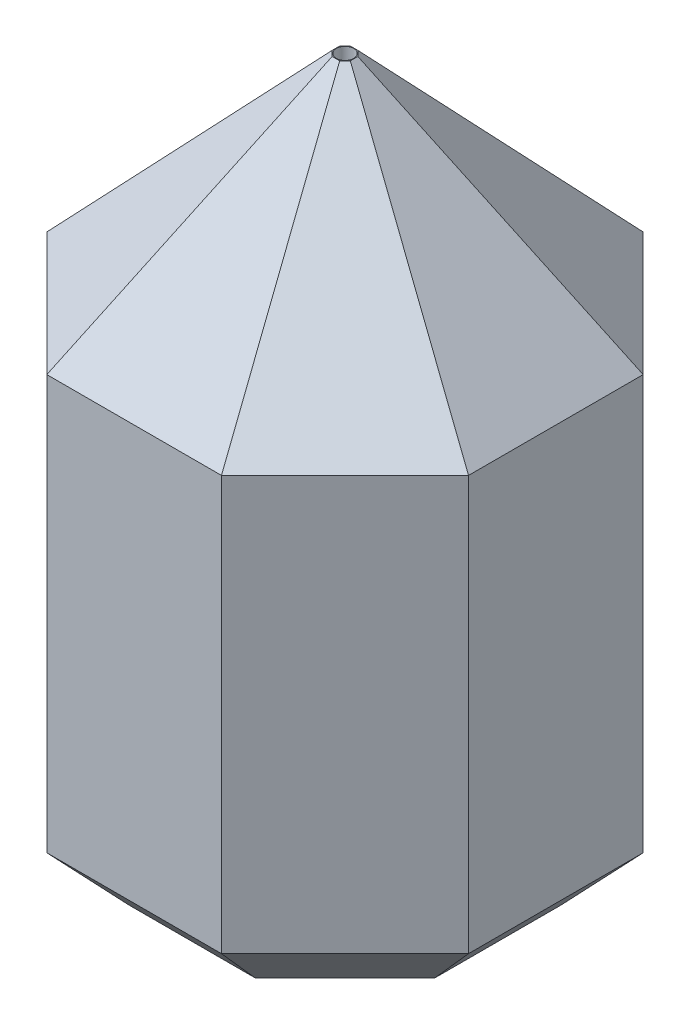
ISO-10303-21;
HEADER;
FILE_DESCRIPTION(('STEP AP214'),'2;1');
FILE_NAME('part.step','',(''),(''),'','','');
FILE_SCHEMA(('AUTOMOTIVE_DESIGN { 1 0 10303 214 1 1 1 1 }'));
ENDSEC;
DATA;
#1=APPLICATION_CONTEXT('core data for automotive mechanical design processes');
#2=APPLICATION_PROTOCOL_DEFINITION('international standard','automotive_design',2000,#1);
#3=PRODUCT_CONTEXT('',#1,'mechanical');
#4=PRODUCT('Part','Part','',(#3));
#5=PRODUCT_RELATED_PRODUCT_CATEGORY('part','',(#4));
#6=PRODUCT_DEFINITION_FORMATION('','',#4);
#7=PRODUCT_DEFINITION_CONTEXT('part definition',#1,'design');
#8=PRODUCT_DEFINITION('design','',#6,#7);
#9=PRODUCT_DEFINITION_SHAPE('','',#8);
#10=(LENGTH_UNIT() NAMED_UNIT(*) SI_UNIT(.MILLI.,.METRE.));
#11=(NAMED_UNIT(*) PLANE_ANGLE_UNIT() SI_UNIT($,.RADIAN.));
#12=(NAMED_UNIT(*) SI_UNIT($,.STERADIAN.) SOLID_ANGLE_UNIT());
#13=UNCERTAINTY_MEASURE_WITH_UNIT(LENGTH_MEASURE(1.E-05),#10,'distance_accuracy_value','');
#14=(GEOMETRIC_REPRESENTATION_CONTEXT(3) GLOBAL_UNCERTAINTY_ASSIGNED_CONTEXT((#13)) GLOBAL_UNIT_ASSIGNED_CONTEXT((#10,
#11,#12)) REPRESENTATION_CONTEXT('',''));
#15=CARTESIAN_POINT('',(0.,0.,0.));
#16=DIRECTION('',(0.,0.,1.));
#17=DIRECTION('',(1.,0.,0.));
#18=AXIS2_PLACEMENT_3D('',#15,#16,#17);
#19=CARTESIAN_POINT('',(0.,85.,0.));
#20=DIRECTION('',(0.,-1.,0.));
#21=DIRECTION('',(0.,0.,-1.));
#22=AXIS2_PLACEMENT_3D('',#19,#20,#21);
#23=PLANE('',#22);
#24=CARTESIAN_POINT('',(0.,85.,0.));
#25=DIRECTION('',(0.,-1.,0.));
#26=DIRECTION('',(0.,0.,-1.));
#27=AXIS2_PLACEMENT_3D('',#24,#25,#26);
#28=CIRCLE('',#27,1.5);
#29=CARTESIAN_POINT('',(0.,85.,-1.5));
#30=VERTEX_POINT('',#29);
#31=EDGE_CURVE('E251',#30,#30,#28,.T.);
#32=ORIENTED_EDGE('',*,*,#31,.F.);
#33=EDGE_LOOP('',(#32));
#34=FACE_BOUND('',#33,.T.);
#35=CARTESIAN_POINT('',(0.,85.,0.));
#36=DIRECTION('',(0.,-1.,0.));
#37=DIRECTION('',(0.,0.,-1.));
#38=AXIS2_PLACEMENT_3D('',#35,#36,#37);
#39=CIRCLE('',#38,8.);
#40=CARTESIAN_POINT('',(0.,85.,8.));
#41=VERTEX_POINT('',#40);
#42=EDGE_CURVE('E301',#41,#41,#39,.F.);
#43=ORIENTED_EDGE('',*,*,#42,.F.);
#44=EDGE_LOOP('',(#43));
#45=FACE_BOUND('',#44,.T.);
#46=ADVANCED_FACE('F37',(#34,#45),#23,.T.);
#47=CARTESIAN_POINT('',(17.,120.,17.));
#48=DIRECTION('',(-1.,0.,0.));
#49=DIRECTION('',(0.,0.,1.));
#50=AXIS2_PLACEMENT_3D('',#47,#48,#49);
#51=PLANE('',#50);
#52=DIRECTION('',(0.,0.,1.));
#53=VECTOR('',#52,1.);
#54=CARTESIAN_POINT('',(17.,72.,-17.));
#55=LINE('',#54,#53);
#56=CARTESIAN_POINT('',(17.,72.,-17.));
#57=VERTEX_POINT('',#56);
#58=CARTESIAN_POINT('',(17.,72.,17.));
#59=VERTEX_POINT('',#58);
#60=EDGE_CURVE('E245',#57,#59,#55,.T.);
#61=ORIENTED_EDGE('',*,*,#60,.F.);
#62=DIRECTION('',(0.,-1.,0.));
#63=VECTOR('',#62,1.);
#64=CARTESIAN_POINT('',(17.,120.,-17.));
#65=LINE('',#64,#63);
#66=CARTESIAN_POINT('',(17.,0.,-17.));
#67=VERTEX_POINT('',#66);
#68=EDGE_CURVE('E277',#57,#67,#65,.T.);
#69=ORIENTED_EDGE('',*,*,#68,.T.);
#70=DIRECTION('',(0.,0.,-1.));
#71=VECTOR('',#70,1.);
#72=CARTESIAN_POINT('',(17.,0.,17.));
#73=LINE('',#72,#71);
#74=CARTESIAN_POINT('',(17.,0.,17.));
#75=VERTEX_POINT('',#74);
#76=EDGE_CURVE('E257',#75,#67,#73,.T.);
#77=ORIENTED_EDGE('',*,*,#76,.F.);
#78=DIRECTION('',(0.,-1.,0.));
#79=VECTOR('',#78,1.);
#80=CARTESIAN_POINT('',(17.,120.,17.));
#81=LINE('',#80,#79);
#82=EDGE_CURVE('E270',#59,#75,#81,.T.);
#83=ORIENTED_EDGE('',*,*,#82,.F.);
#84=EDGE_LOOP('',(#61,#69,#77,#83));
#85=FACE_BOUND('',#84,.T.);
#86=ADVANCED_FACE('F514',(#85),#51,.T.);
#87=CARTESIAN_POINT('',(-17.,120.,-17.));
#88=DIRECTION('',(0.,0.,1.));
#89=DIRECTION('',(1.,0.,0.));
#90=AXIS2_PLACEMENT_3D('',#87,#88,#89);
#91=PLANE('',#90);
#92=DIRECTION('',(1.,0.,0.));
#93=VECTOR('',#92,1.);
#94=CARTESIAN_POINT('',(-17.,72.,-17.));
#95=LINE('',#94,#93);
#96=CARTESIAN_POINT('',(-17.,72.,-17.));
#97=VERTEX_POINT('',#96);
#98=EDGE_CURVE('E242',#97,#57,#95,.T.);
#99=ORIENTED_EDGE('',*,*,#98,.F.);
#100=DIRECTION('',(0.,-1.,0.));
#101=VECTOR('',#100,1.);
#102=CARTESIAN_POINT('',(-17.,120.,-17.));
#103=LINE('',#102,#101);
#104=CARTESIAN_POINT('',(-17.,0.,-17.));
#105=VERTEX_POINT('',#104);
#106=EDGE_CURVE('E275',#97,#105,#103,.T.);
#107=ORIENTED_EDGE('',*,*,#106,.T.);
#108=DIRECTION('',(-1.,0.,0.));
#109=VECTOR('',#108,1.);
#110=CARTESIAN_POINT('',(-17.,0.,-17.));
#111=LINE('',#110,#109);
#112=EDGE_CURVE('E260',#67,#105,#111,.T.);
#113=ORIENTED_EDGE('',*,*,#112,.F.);
#114=ORIENTED_EDGE('',*,*,#68,.F.);
#115=EDGE_LOOP('',(#99,#107,#113,#114));
#116=FACE_BOUND('',#115,.T.);
#117=ADVANCED_FACE('F520',(#116),#91,.T.);
#118=CARTESIAN_POINT('',(-17.,120.,17.));
#119=DIRECTION('',(1.,0.,0.));
#120=DIRECTION('',(0.,0.,-1.));
#121=AXIS2_PLACEMENT_3D('',#118,#119,#120);
#122=PLANE('',#121);
#123=DIRECTION('',(0.,-1.,0.));
#124=VECTOR('',#123,1.);
#125=CARTESIAN_POINT('',(-17.,20.,2.));
#126=LINE('',#125,#124);
#127=CARTESIAN_POINT('',(-17.,20.,2.));
#128=VERTEX_POINT('',#127);
#129=CARTESIAN_POINT('',(-17.,0.,2.));
#130=VERTEX_POINT('',#129);
#131=EDGE_CURVE('E232',#128,#130,#126,.T.);
#132=ORIENTED_EDGE('',*,*,#131,.F.);
#133=DIRECTION('',(0.,0.,1.));
#134=VECTOR('',#133,1.);
#135=CARTESIAN_POINT('',(-17.,20.,0.));
#136=LINE('',#135,#134);
#137=CARTESIAN_POINT('',(-17.,20.,-2.));
#138=VERTEX_POINT('',#137);
#139=EDGE_CURVE('E209',#138,#128,#136,.T.);
#140=ORIENTED_EDGE('',*,*,#139,.F.);
#141=DIRECTION('',(0.,-1.,0.));
#142=VECTOR('',#141,1.);
#143=CARTESIAN_POINT('',(-17.,20.,-2.));
#144=LINE('',#143,#142);
#145=CARTESIAN_POINT('',(-17.,0.,-2.));
#146=VERTEX_POINT('',#145);
#147=EDGE_CURVE('E205',#138,#146,#144,.T.);
#148=ORIENTED_EDGE('',*,*,#147,.T.);
#149=DIRECTION('',(0.,0.,1.));
#150=VECTOR('',#149,1.);
#151=CARTESIAN_POINT('',(-17.,0.,17.));
#152=LINE('',#151,#150);
#153=EDGE_CURVE('E264',#105,#146,#152,.T.);
#154=ORIENTED_EDGE('',*,*,#153,.F.);
#155=ORIENTED_EDGE('',*,*,#106,.F.);
#156=DIRECTION('',(0.,0.,-1.));
#157=VECTOR('',#156,1.);
#158=CARTESIAN_POINT('',(-17.,72.,17.));
#159=LINE('',#158,#157);
#160=CARTESIAN_POINT('',(-17.,72.,17.));
#161=VERTEX_POINT('',#160);
#162=EDGE_CURVE('E238',#161,#97,#159,.T.);
#163=ORIENTED_EDGE('',*,*,#162,.F.);
#164=DIRECTION('',(0.,-1.,0.));
#165=VECTOR('',#164,1.);
#166=CARTESIAN_POINT('',(-17.,120.,17.));
#167=LINE('',#166,#165);
#168=CARTESIAN_POINT('',(-17.,0.,17.));
#169=VERTEX_POINT('',#168);
#170=EDGE_CURVE('E272',#161,#169,#167,.T.);
#171=ORIENTED_EDGE('',*,*,#170,.T.);
#172=EDGE_CURVE('E263',#130,#169,#152,.T.);
#173=ORIENTED_EDGE('',*,*,#172,.F.);
#174=EDGE_LOOP('',(#132,#140,#148,#154,#155,#163,#171,#173));
#175=FACE_BOUND('',#174,.T.);
#176=ADVANCED_FACE('F534',(#175),#122,.T.);
#177=CARTESIAN_POINT('',(-17.,120.,17.));
#178=DIRECTION('',(0.,0.,-1.));
#179=DIRECTION('',(-1.,0.,0.));
#180=AXIS2_PLACEMENT_3D('',#177,#178,#179);
#181=PLANE('',#180);
#182=DIRECTION('',(-1.,0.,0.));
#183=VECTOR('',#182,1.);
#184=CARTESIAN_POINT('',(17.,72.,17.));
#185=LINE('',#184,#183);
#186=EDGE_CURVE('E248',#59,#161,#185,.T.);
#187=ORIENTED_EDGE('',*,*,#186,.F.);
#188=ORIENTED_EDGE('',*,*,#82,.T.);
#189=DIRECTION('',(1.,0.,0.));
#190=VECTOR('',#189,1.);
#191=CARTESIAN_POINT('',(-17.,0.,17.));
#192=LINE('',#191,#190);
#193=EDGE_CURVE('E267',#169,#75,#192,.T.);
#194=ORIENTED_EDGE('',*,*,#193,.F.);
#195=ORIENTED_EDGE('',*,*,#170,.F.);
#196=EDGE_LOOP('',(#187,#188,#194,#195));
#197=FACE_BOUND('',#196,.T.);
#198=ADVANCED_FACE('F531',(#197),#181,.T.);
#199=CARTESIAN_POINT('',(0.,120.,0.));
#200=DIRECTION('',(0.,1.,0.));
#201=DIRECTION('',(0.,0.,1.));
#202=AXIS2_PLACEMENT_3D('',#199,#200,#201);
#203=PLANE('',#202);
#204=DIRECTION('',(-0.707106781186548,0.,-0.707106781186547));
#205=VECTOR('',#204,1.);
#206=CARTESIAN_POINT('',(-9.59100131693012,120.,-11.8145902740914));
#207=LINE('',#206,#205);
#208=CARTESIAN_POINT('',(1.57231483018025,120.,-0.651274126981041));
#209=VERTEX_POINT('',#208);
#210=CARTESIAN_POINT('',(0.651274126981014,120.,-1.57231483018028));
#211=VERTEX_POINT('',#210);
#212=EDGE_CURVE('E310',#209,#211,#207,.T.);
#213=ORIENTED_EDGE('',*,*,#212,.T.);
#214=DIRECTION('',(-1.,0.,0.));
#215=VECTOR('',#214,1.);
#216=CARTESIAN_POINT('',(-15.1360389693211,120.,-1.57231483018028));
#217=LINE('',#216,#215);
#218=CARTESIAN_POINT('',(-0.651274126981009,120.,-1.57231483018028));
#219=VERTEX_POINT('',#218);
#220=EDGE_CURVE('E318',#211,#219,#217,.T.);
#221=ORIENTED_EDGE('',*,*,#220,.T.);
#222=DIRECTION('',(-0.707106781186547,0.,0.707106781186548));
#223=VECTOR('',#222,1.);
#224=CARTESIAN_POINT('',(-11.8145902740914,120.,9.59100131693014));
#225=LINE('',#224,#223);
#226=CARTESIAN_POINT('',(-1.57231483018027,120.,-0.651274126981013));
#227=VERTEX_POINT('',#226);
#228=EDGE_CURVE('E316',#219,#227,#225,.T.);
#229=ORIENTED_EDGE('',*,*,#228,.T.);
#230=DIRECTION('',(0.,0.,1.));
#231=VECTOR('',#230,1.);
#232=CARTESIAN_POINT('',(-1.57231483018027,120.,15.1360389693211));
#233=LINE('',#232,#231);
#234=CARTESIAN_POINT('',(-1.57231483018027,120.,0.651274126981008));
#235=VERTEX_POINT('',#234);
#236=EDGE_CURVE('E314',#227,#235,#233,.T.);
#237=ORIENTED_EDGE('',*,*,#236,.T.);
#238=DIRECTION('',(0.707106781186548,0.,0.707106781186547));
#239=VECTOR('',#238,1.);
#240=CARTESIAN_POINT('',(9.59100131693013,120.,11.8145902740914));
#241=LINE('',#240,#239);
#242=CARTESIAN_POINT('',(-0.651274126981029,120.,1.57231483018025));
#243=VERTEX_POINT('',#242);
#244=EDGE_CURVE('E312',#235,#243,#241,.T.);
#245=ORIENTED_EDGE('',*,*,#244,.T.);
#246=DIRECTION('',(1.,0.,0.));
#247=VECTOR('',#246,1.);
#248=CARTESIAN_POINT('',(15.1360389693211,120.,1.57231483018025));
#249=LINE('',#248,#247);
#250=CARTESIAN_POINT('',(0.651274126981014,120.,1.57231483018025));
#251=VERTEX_POINT('',#250);
#252=EDGE_CURVE('E304',#243,#251,#249,.T.);
#253=ORIENTED_EDGE('',*,*,#252,.T.);
#254=DIRECTION('',(0.707106781186547,0.,-0.707106781186548));
#255=VECTOR('',#254,1.);
#256=CARTESIAN_POINT('',(11.8145902740914,120.,-9.59100131693013));
#257=LINE('',#256,#255);
#258=CARTESIAN_POINT('',(1.57231483018025,120.,0.651274126981019));
#259=VERTEX_POINT('',#258);
#260=EDGE_CURVE('E306',#251,#259,#257,.T.);
#261=ORIENTED_EDGE('',*,*,#260,.T.);
#262=DIRECTION('',(0.,0.,-1.));
#263=VECTOR('',#262,1.);
#264=CARTESIAN_POINT('',(1.57231483018025,120.,-15.1360389693211));
#265=LINE('',#264,#263);
#266=EDGE_CURVE('E308',#259,#209,#265,.T.);
#267=ORIENTED_EDGE('',*,*,#266,.T.);
#268=EDGE_LOOP('',(#213,#221,#229,#237,#245,#253,#261,#267));
#269=FACE_BOUND('',#268,.T.);
#270=CARTESIAN_POINT('',(0.,120.,0.));
#271=DIRECTION('',(0.,1.,0.));
#272=DIRECTION('',(0.,0.,1.));
#273=AXIS2_PLACEMENT_3D('',#270,#271,#272);
#274=CIRCLE('',#273,1.5);
#275=CARTESIAN_POINT('',(0.,120.,1.5));
#276=VERTEX_POINT('',#275);
#277=EDGE_CURVE('E254',#276,#276,#274,.T.);
#278=ORIENTED_EDGE('',*,*,#277,.F.);
#279=EDGE_LOOP('',(#278));
#280=FACE_BOUND('',#279,.T.);
#281=ADVANCED_FACE('F471',(#269,#280),#203,.T.);
#282=CARTESIAN_POINT('',(0.,0.,0.));
#283=DIRECTION('',(0.,1.,0.));
#284=DIRECTION('',(0.,0.,1.));
#285=AXIS2_PLACEMENT_3D('',#282,#283,#284);
#286=PLANE('',#285);
#287=DIRECTION('',(-1.,0.,0.));
#288=VECTOR('',#287,1.);
#289=CARTESIAN_POINT('',(0.,0.,26.5416305603426));
#290=LINE('',#289,#288);
#291=CARTESIAN_POINT('',(10.9939033455901,0.,26.5416305603426));
#292=VERTEX_POINT('',#291);
#293=CARTESIAN_POINT('',(-10.9939033455901,0.,26.5416305603426));
#294=VERTEX_POINT('',#293);
#295=EDGE_CURVE('E362',#292,#294,#290,.T.);
#296=ORIENTED_EDGE('',*,*,#295,.T.);
#297=DIRECTION('',(-0.707106781186548,0.,-0.707106781186547));
#298=VECTOR('',#297,1.);
#299=CARTESIAN_POINT('',(-18.7677669529663,0.,18.7677669529664));
#300=LINE('',#299,#298);
#301=CARTESIAN_POINT('',(-26.5416305603426,0.,10.9939033455901));
#302=VERTEX_POINT('',#301);
#303=EDGE_CURVE('E376',#294,#302,#300,.T.);
#304=ORIENTED_EDGE('',*,*,#303,.T.);
#305=DIRECTION('',(0.,0.,-1.));
#306=VECTOR('',#305,1.);
#307=CARTESIAN_POINT('',(-26.5416305603426,0.,0.));
#308=LINE('',#307,#306);
#309=CARTESIAN_POINT('',(-26.5416305603426,0.,-10.9939033455901));
#310=VERTEX_POINT('',#309);
#311=EDGE_CURVE('E374',#302,#310,#308,.T.);
#312=ORIENTED_EDGE('',*,*,#311,.T.);
#313=DIRECTION('',(0.707106781186547,0.,-0.707106781186548));
#314=VECTOR('',#313,1.);
#315=CARTESIAN_POINT('',(-18.7677669529663,0.,-18.7677669529663));
#316=LINE('',#315,#314);
#317=CARTESIAN_POINT('',(-10.9939033455901,0.,-26.5416305603426));
#318=VERTEX_POINT('',#317);
#319=EDGE_CURVE('E372',#310,#318,#316,.T.);
#320=ORIENTED_EDGE('',*,*,#319,.T.);
#321=DIRECTION('',(1.,0.,0.));
#322=VECTOR('',#321,1.);
#323=CARTESIAN_POINT('',(0.,0.,-26.5416305603426));
#324=LINE('',#323,#322);
#325=CARTESIAN_POINT('',(10.9939033455901,0.,-26.5416305603426));
#326=VERTEX_POINT('',#325);
#327=EDGE_CURVE('E370',#318,#326,#324,.T.);
#328=ORIENTED_EDGE('',*,*,#327,.T.);
#329=DIRECTION('',(0.707106781186548,0.,0.707106781186547));
#330=VECTOR('',#329,1.);
#331=CARTESIAN_POINT('',(18.7677669529663,0.,-18.7677669529664));
#332=LINE('',#331,#330);
#333=CARTESIAN_POINT('',(26.5416305603426,0.,-10.9939033455901));
#334=VERTEX_POINT('',#333);
#335=EDGE_CURVE('E368',#326,#334,#332,.T.);
#336=ORIENTED_EDGE('',*,*,#335,.T.);
#337=DIRECTION('',(0.,0.,1.));
#338=VECTOR('',#337,1.);
#339=CARTESIAN_POINT('',(26.5416305603426,0.,0.));
#340=LINE('',#339,#338);
#341=CARTESIAN_POINT('',(26.5416305603426,0.,10.9939033455901));
#342=VERTEX_POINT('',#341);
#343=EDGE_CURVE('E366',#334,#342,#340,.T.);
#344=ORIENTED_EDGE('',*,*,#343,.T.);
#345=DIRECTION('',(-0.707106781186547,0.,0.707106781186548));
#346=VECTOR('',#345,1.);
#347=CARTESIAN_POINT('',(18.7677669529664,0.,18.7677669529663));
#348=LINE('',#347,#346);
#349=EDGE_CURVE('E364',#342,#292,#348,.T.);
#350=ORIENTED_EDGE('',*,*,#349,.T.);
#351=EDGE_LOOP('',(#296,#304,#312,#320,#328,#336,#344,#350));
#352=FACE_BOUND('',#351,.T.);
#353=DIRECTION('',(0.,0.,1.));
#354=VECTOR('',#353,1.);
#355=CARTESIAN_POINT('',(-22.,0.,0.));
#356=LINE('',#355,#354);
#357=CARTESIAN_POINT('',(-22.,0.,-2.));
#358=VERTEX_POINT('',#357);
#359=CARTESIAN_POINT('',(-22.,0.,2.));
#360=VERTEX_POINT('',#359);
#361=EDGE_CURVE('E54',#358,#360,#356,.T.);
#362=ORIENTED_EDGE('',*,*,#361,.T.);
#363=DIRECTION('',(-1.,0.,0.));
#364=VECTOR('',#363,1.);
#365=CARTESIAN_POINT('',(0.,0.,2.));
#366=LINE('',#365,#364);
#367=EDGE_CURVE('E219',#130,#360,#366,.T.);
#368=ORIENTED_EDGE('',*,*,#367,.F.);
#369=ORIENTED_EDGE('',*,*,#172,.T.);
#370=ORIENTED_EDGE('',*,*,#193,.T.);
#371=ORIENTED_EDGE('',*,*,#76,.T.);
#372=ORIENTED_EDGE('',*,*,#112,.T.);
#373=ORIENTED_EDGE('',*,*,#153,.T.);
#374=DIRECTION('',(-1.,0.,0.));
#375=VECTOR('',#374,1.);
#376=CARTESIAN_POINT('',(0.,0.,-2.));
#377=LINE('',#376,#375);
#378=EDGE_CURVE('E222',#146,#358,#377,.T.);
#379=ORIENTED_EDGE('',*,*,#378,.T.);
#380=EDGE_LOOP('',(#362,#368,#369,#370,#371,#372,#373,#379));
#381=FACE_BOUND('',#380,.T.);
#382=ADVANCED_FACE('F421',(#352,#381),#286,.F.);
#383=CARTESIAN_POINT('',(15.1360389693211,120.,-36.5416305603426));
#384=DIRECTION('',(0.,0.,1.));
#385=DIRECTION('',(1.,0.,0.));
#386=AXIS2_PLACEMENT_3D('',#383,#384,#385);
#387=PLANE('',#386);
#388=DIRECTION('',(0.,-1.,0.));
#389=VECTOR('',#388,1.);
#390=CARTESIAN_POINT('',(15.1360389693211,120.,-36.5416305603426));
#391=LINE('',#390,#389);
#392=CARTESIAN_POINT('',(15.1360389693211,82.4999999999998,-36.5416305603426));
#393=VERTEX_POINT('',#392);
#394=CARTESIAN_POINT('',(15.1360389693211,10.7236871002468,-36.5416305603426));
#395=VERTEX_POINT('',#394);
#396=EDGE_CURVE('E279',#393,#395,#391,.T.);
#397=ORIENTED_EDGE('',*,*,#396,.T.);
#398=DIRECTION('',(-1.,0.,0.));
#399=VECTOR('',#398,1.);
#400=CARTESIAN_POINT('',(15.1360389693211,10.7236871002468,-36.5416305603426));
#401=LINE('',#400,#399);
#402=CARTESIAN_POINT('',(-15.1360389693211,10.7236871002468,-36.5416305603426));
#403=VERTEX_POINT('',#402);
#404=EDGE_CURVE('E383',#395,#403,#401,.T.);
#405=ORIENTED_EDGE('',*,*,#404,.T.);
#406=DIRECTION('',(0.,-1.,0.));
#407=VECTOR('',#406,1.);
#408=CARTESIAN_POINT('',(-15.1360389693211,120.,-36.5416305603426));
#409=LINE('',#408,#407);
#410=CARTESIAN_POINT('',(-15.1360389693211,82.4999999999998,-36.5416305603426));
#411=VERTEX_POINT('',#410);
#412=EDGE_CURVE('E298',#411,#403,#409,.T.);
#413=ORIENTED_EDGE('',*,*,#412,.F.);
#414=DIRECTION('',(1.,0.,0.));
#415=VECTOR('',#414,1.);
#416=CARTESIAN_POINT('',(15.1360389693211,82.4999999999998,-36.5416305603426));
#417=LINE('',#416,#415);
#418=EDGE_CURVE('E321',#411,#393,#417,.T.);
#419=ORIENTED_EDGE('',*,*,#418,.T.);
#420=EDGE_LOOP('',(#397,#405,#413,#419));
#421=FACE_BOUND('',#420,.T.);
#422=ADVANCED_FACE('F459',(#421),#387,.F.);
#423=CARTESIAN_POINT('',(-15.1360389693211,120.,-36.5416305603426));
#424=DIRECTION('',(0.707106781186548,0.,0.707106781186547));
#425=DIRECTION('',(0.707106781186547,0.,-0.707106781186548));
#426=AXIS2_PLACEMENT_3D('',#423,#424,#425);
#427=PLANE('',#426);
#428=ORIENTED_EDGE('',*,*,#412,.T.);
#429=DIRECTION('',(-0.707106781186547,0.,0.707106781186548));
#430=VECTOR('',#429,1.);
#431=CARTESIAN_POINT('',(-15.1360389693211,10.7236871002468,-36.5416305603426));
#432=LINE('',#431,#430);
#433=CARTESIAN_POINT('',(-36.5416305603426,10.7236871002468,-15.1360389693211));
#434=VERTEX_POINT('',#433);
#435=EDGE_CURVE('E381',#403,#434,#432,.T.);
#436=ORIENTED_EDGE('',*,*,#435,.T.);
#437=DIRECTION('',(0.,-1.,0.));
#438=VECTOR('',#437,1.);
#439=CARTESIAN_POINT('',(-36.5416305603426,120.,-15.1360389693211));
#440=LINE('',#439,#438);
#441=CARTESIAN_POINT('',(-36.5416305603426,82.4999999999998,-15.1360389693211));
#442=VERTEX_POINT('',#441);
#443=EDGE_CURVE('E295',#442,#434,#440,.T.);
#444=ORIENTED_EDGE('',*,*,#443,.F.);
#445=DIRECTION('',(0.707106781186547,0.,-0.707106781186548));
#446=VECTOR('',#445,1.);
#447=CARTESIAN_POINT('',(-15.1360389693211,82.4999999999998,-36.5416305603426));
#448=LINE('',#447,#446);
#449=EDGE_CURVE('E324',#442,#411,#448,.T.);
#450=ORIENTED_EDGE('',*,*,#449,.T.);
#451=EDGE_LOOP('',(#428,#436,#444,#450));
#452=FACE_BOUND('',#451,.T.);
#453=ADVANCED_FACE('F455',(#452),#427,.F.);
#454=CARTESIAN_POINT('',(-36.5416305603426,120.,-15.1360389693211));
#455=DIRECTION('',(1.,0.,0.));
#456=DIRECTION('',(0.,0.,-1.));
#457=AXIS2_PLACEMENT_3D('',#454,#455,#456);
#458=PLANE('',#457);
#459=ORIENTED_EDGE('',*,*,#443,.T.);
#460=DIRECTION('',(0.,0.,1.));
#461=VECTOR('',#460,1.);
#462=CARTESIAN_POINT('',(-36.5416305603426,10.7236871002468,-15.1360389693211));
#463=LINE('',#462,#461);
#464=CARTESIAN_POINT('',(-36.5416305603426,10.7236871002468,15.1360389693211));
#465=VERTEX_POINT('',#464);
#466=EDGE_CURVE('E379',#434,#465,#463,.T.);
#467=ORIENTED_EDGE('',*,*,#466,.T.);
#468=DIRECTION('',(0.,-1.,0.));
#469=VECTOR('',#468,1.);
#470=CARTESIAN_POINT('',(-36.5416305603426,120.,15.1360389693211));
#471=LINE('',#470,#469);
#472=CARTESIAN_POINT('',(-36.5416305603426,82.4999999999998,15.1360389693211));
#473=VERTEX_POINT('',#472);
#474=EDGE_CURVE('E292',#473,#465,#471,.T.);
#475=ORIENTED_EDGE('',*,*,#474,.F.);
#476=DIRECTION('',(0.,0.,-1.));
#477=VECTOR('',#476,1.);
#478=CARTESIAN_POINT('',(-36.5416305603426,82.4999999999998,-15.1360389693211));
#479=LINE('',#478,#477);
#480=EDGE_CURVE('E326',#473,#442,#479,.T.);
#481=ORIENTED_EDGE('',*,*,#480,.T.);
#482=EDGE_LOOP('',(#459,#467,#475,#481));
#483=FACE_BOUND('',#482,.T.);
#484=ADVANCED_FACE('F437',(#483),#458,.F.);
#485=CARTESIAN_POINT('',(-36.5416305603426,120.,15.1360389693211));
#486=DIRECTION('',(0.707106781186547,0.,-0.707106781186548));
#487=DIRECTION('',(-0.707106781186548,0.,-0.707106781186547));
#488=AXIS2_PLACEMENT_3D('',#485,#486,#487);
#489=PLANE('',#488);
#490=ORIENTED_EDGE('',*,*,#474,.T.);
#491=DIRECTION('',(0.707106781186548,0.,0.707106781186547));
#492=VECTOR('',#491,1.);
#493=CARTESIAN_POINT('',(-36.5416305603426,10.7236871002468,15.1360389693211));
#494=LINE('',#493,#492);
#495=CARTESIAN_POINT('',(-15.1360389693211,10.7236871002468,36.5416305603426));
#496=VERTEX_POINT('',#495);
#497=EDGE_CURVE('E338',#465,#496,#494,.T.);
#498=ORIENTED_EDGE('',*,*,#497,.T.);
#499=DIRECTION('',(0.,-1.,0.));
#500=VECTOR('',#499,1.);
#501=CARTESIAN_POINT('',(-15.1360389693211,120.,36.5416305603426));
#502=LINE('',#501,#500);
#503=CARTESIAN_POINT('',(-15.1360389693211,82.4999999999998,36.5416305603426));
#504=VERTEX_POINT('',#503);
#505=EDGE_CURVE('E290',#504,#496,#502,.T.);
#506=ORIENTED_EDGE('',*,*,#505,.F.);
#507=DIRECTION('',(-0.707106781186548,0.,-0.707106781186547));
#508=VECTOR('',#507,1.);
#509=CARTESIAN_POINT('',(-36.5416305603426,82.4999999999998,15.1360389693211));
#510=LINE('',#509,#508);
#511=EDGE_CURVE('E328',#504,#473,#510,.T.);
#512=ORIENTED_EDGE('',*,*,#511,.T.);
#513=EDGE_LOOP('',(#490,#498,#506,#512));
#514=FACE_BOUND('',#513,.T.);
#515=ADVANCED_FACE('F441',(#514),#489,.F.);
#516=CARTESIAN_POINT('',(-15.1360389693211,120.,36.5416305603426));
#517=DIRECTION('',(0.,0.,-1.));
#518=DIRECTION('',(-1.,0.,0.));
#519=AXIS2_PLACEMENT_3D('',#516,#517,#518);
#520=PLANE('',#519);
#521=ORIENTED_EDGE('',*,*,#505,.T.);
#522=DIRECTION('',(1.,0.,0.));
#523=VECTOR('',#522,1.);
#524=CARTESIAN_POINT('',(-15.1360389693211,10.7236871002468,36.5416305603426));
#525=LINE('',#524,#523);
#526=CARTESIAN_POINT('',(15.1360389693211,10.7236871002468,36.5416305603426));
#527=VERTEX_POINT('',#526);
#528=EDGE_CURVE('E11',#496,#527,#525,.T.);
#529=ORIENTED_EDGE('',*,*,#528,.T.);
#530=DIRECTION('',(0.,-1.,0.));
#531=VECTOR('',#530,1.);
#532=CARTESIAN_POINT('',(15.1360389693211,120.,36.5416305603426));
#533=LINE('',#532,#531);
#534=CARTESIAN_POINT('',(15.1360389693211,82.4999999999998,36.5416305603426));
#535=VERTEX_POINT('',#534);
#536=EDGE_CURVE('E288',#535,#527,#533,.T.);
#537=ORIENTED_EDGE('',*,*,#536,.F.);
#538=DIRECTION('',(-1.,0.,0.));
#539=VECTOR('',#538,1.);
#540=CARTESIAN_POINT('',(-15.1360389693211,82.4999999999998,36.5416305603426));
#541=LINE('',#540,#539);
#542=EDGE_CURVE('E336',#535,#504,#541,.T.);
#543=ORIENTED_EDGE('',*,*,#542,.T.);
#544=EDGE_LOOP('',(#521,#529,#537,#543));
#545=FACE_BOUND('',#544,.T.);
#546=ADVANCED_FACE('F497',(#545),#520,.F.);
#547=CARTESIAN_POINT('',(15.1360389693211,120.,36.5416305603426));
#548=DIRECTION('',(-0.707106781186548,0.,-0.707106781186547));
#549=DIRECTION('',(-0.707106781186547,0.,0.707106781186548));
#550=AXIS2_PLACEMENT_3D('',#547,#548,#549);
#551=PLANE('',#550);
#552=ORIENTED_EDGE('',*,*,#536,.T.);
#553=DIRECTION('',(0.707106781186547,0.,-0.707106781186548));
#554=VECTOR('',#553,1.);
#555=CARTESIAN_POINT('',(15.1360389693211,10.7236871002468,36.5416305603426));
#556=LINE('',#555,#554);
#557=CARTESIAN_POINT('',(36.5416305603426,10.7236871002468,15.1360389693211));
#558=VERTEX_POINT('',#557);
#559=EDGE_CURVE('E46',#527,#558,#556,.T.);
#560=ORIENTED_EDGE('',*,*,#559,.T.);
#561=DIRECTION('',(0.,-1.,0.));
#562=VECTOR('',#561,1.);
#563=CARTESIAN_POINT('',(36.5416305603426,120.,15.1360389693211));
#564=LINE('',#563,#562);
#565=CARTESIAN_POINT('',(36.5416305603426,82.4999999999998,15.1360389693211));
#566=VERTEX_POINT('',#565);
#567=EDGE_CURVE('E285',#566,#558,#564,.T.);
#568=ORIENTED_EDGE('',*,*,#567,.F.);
#569=DIRECTION('',(-0.707106781186547,0.,0.707106781186548));
#570=VECTOR('',#569,1.);
#571=CARTESIAN_POINT('',(15.1360389693211,82.4999999999998,36.5416305603426));
#572=LINE('',#571,#570);
#573=EDGE_CURVE('E334',#566,#535,#572,.T.);
#574=ORIENTED_EDGE('',*,*,#573,.T.);
#575=EDGE_LOOP('',(#552,#560,#568,#574));
#576=FACE_BOUND('',#575,.T.);
#577=ADVANCED_FACE('F494',(#576),#551,.F.);
#578=CARTESIAN_POINT('',(36.5416305603426,120.,15.1360389693211));
#579=DIRECTION('',(-1.,0.,0.));
#580=DIRECTION('',(0.,0.,1.));
#581=AXIS2_PLACEMENT_3D('',#578,#579,#580);
#582=PLANE('',#581);
#583=ORIENTED_EDGE('',*,*,#567,.T.);
#584=DIRECTION('',(0.,0.,-1.));
#585=VECTOR('',#584,1.);
#586=CARTESIAN_POINT('',(36.5416305603426,10.7236871002468,15.1360389693211));
#587=LINE('',#586,#585);
#588=CARTESIAN_POINT('',(36.5416305603426,10.7236871002468,-15.1360389693211));
#589=VERTEX_POINT('',#588);
#590=EDGE_CURVE('E387',#558,#589,#587,.T.);
#591=ORIENTED_EDGE('',*,*,#590,.T.);
#592=DIRECTION('',(0.,-1.,0.));
#593=VECTOR('',#592,1.);
#594=CARTESIAN_POINT('',(36.5416305603426,120.,-15.1360389693211));
#595=LINE('',#594,#593);
#596=CARTESIAN_POINT('',(36.5416305603426,82.4999999999998,-15.1360389693211));
#597=VERTEX_POINT('',#596);
#598=EDGE_CURVE('E282',#597,#589,#595,.T.);
#599=ORIENTED_EDGE('',*,*,#598,.F.);
#600=DIRECTION('',(0.,0.,1.));
#601=VECTOR('',#600,1.);
#602=CARTESIAN_POINT('',(36.5416305603426,82.4999999999998,15.1360389693211));
#603=LINE('',#602,#601);
#604=EDGE_CURVE('E332',#597,#566,#603,.T.);
#605=ORIENTED_EDGE('',*,*,#604,.T.);
#606=EDGE_LOOP('',(#583,#591,#599,#605));
#607=FACE_BOUND('',#606,.T.);
#608=ADVANCED_FACE('F483',(#607),#582,.F.);
#609=CARTESIAN_POINT('',(36.5416305603426,120.,-15.1360389693211));
#610=DIRECTION('',(-0.707106781186547,0.,0.707106781186548));
#611=DIRECTION('',(0.707106781186548,0.,0.707106781186547));
#612=AXIS2_PLACEMENT_3D('',#609,#610,#611);
#613=PLANE('',#612);
#614=ORIENTED_EDGE('',*,*,#598,.T.);
#615=DIRECTION('',(-0.707106781186548,0.,-0.707106781186547));
#616=VECTOR('',#615,1.);
#617=CARTESIAN_POINT('',(36.5416305603426,10.7236871002468,-15.1360389693211));
#618=LINE('',#617,#616);
#619=EDGE_CURVE('E385',#589,#395,#618,.T.);
#620=ORIENTED_EDGE('',*,*,#619,.T.);
#621=ORIENTED_EDGE('',*,*,#396,.F.);
#622=DIRECTION('',(0.707106781186548,0.,0.707106781186547));
#623=VECTOR('',#622,1.);
#624=CARTESIAN_POINT('',(36.5416305603426,82.4999999999998,-15.1360389693211));
#625=LINE('',#624,#623);
#626=EDGE_CURVE('E330',#393,#597,#625,.T.);
#627=ORIENTED_EDGE('',*,*,#626,.T.);
#628=EDGE_LOOP('',(#614,#620,#621,#627));
#629=FACE_BOUND('',#628,.T.);
#630=ADVANCED_FACE('F480',(#629),#613,.F.);
#631=CARTESIAN_POINT('',(0.,100.,0.));
#632=DIRECTION('',(0.,1.,0.));
#633=DIRECTION('',(0.,0.,1.));
#634=AXIS2_PLACEMENT_3D('',#631,#632,#633);
#635=CYLINDRICAL_SURFACE('',#634,1.5);
#636=ORIENTED_EDGE('',*,*,#277,.T.);
#637=EDGE_LOOP('',(#636));
#638=FACE_BOUND('',#637,.T.);
#639=ORIENTED_EDGE('',*,*,#31,.T.);
#640=EDGE_LOOP('',(#639));
#641=FACE_BOUND('',#640,.T.);
#642=ADVANCED_FACE('F527',(#638,#641),#635,.F.);
#643=CARTESIAN_POINT('',(0.,72.,0.));
#644=DIRECTION('',(0.,-1.,0.));
#645=DIRECTION('',(0.,0.,-1.));
#646=AXIS2_PLACEMENT_3D('',#643,#644,#645);
#647=PLANE('',#646);
#648=ORIENTED_EDGE('',*,*,#162,.T.);
#649=ORIENTED_EDGE('',*,*,#98,.T.);
#650=ORIENTED_EDGE('',*,*,#60,.T.);
#651=ORIENTED_EDGE('',*,*,#186,.T.);
#652=EDGE_LOOP('',(#648,#649,#650,#651));
#653=FACE_BOUND('',#652,.T.);
#654=CARTESIAN_POINT('',(0.,72.,0.));
#655=DIRECTION('',(0.,-1.,0.));
#656=DIRECTION('',(0.,0.,-1.));
#657=AXIS2_PLACEMENT_3D('',#654,#655,#656);
#658=CIRCLE('',#657,8.);
#659=CARTESIAN_POINT('',(0.,72.,8.));
#660=VERTEX_POINT('',#659);
#661=EDGE_CURVE('E235',#660,#660,#658,.T.);
#662=ORIENTED_EDGE('',*,*,#661,.F.);
#663=EDGE_LOOP('',(#662));
#664=FACE_BOUND('',#663,.T.);
#665=ADVANCED_FACE('F509',(#653,#664),#647,.T.);
#666=CARTESIAN_POINT('',(0.,72.,0.));
#667=DIRECTION('',(0.,1.,0.));
#668=DIRECTION('',(0.,0.,1.));
#669=AXIS2_PLACEMENT_3D('',#666,#667,#668);
#670=CYLINDRICAL_SURFACE('',#669,8.);
#671=CARTESIAN_POINT('',(0.,72.,8.));
#672=CARTESIAN_POINT('',(0.,72.1354166666667,8.));
#673=CARTESIAN_POINT('',(0.,72.2708333333333,8.));
#674=CARTESIAN_POINT('',(0.,72.5416666666667,8.));
#675=CARTESIAN_POINT('',(0.,72.6770833333333,8.));
#676=CARTESIAN_POINT('',(0.,72.9479166666667,8.));
#677=CARTESIAN_POINT('',(0.,73.0833333333333,8.));
#678=CARTESIAN_POINT('',(0.,73.3541666666667,8.));
#679=CARTESIAN_POINT('',(0.,73.4895833333333,8.));
#680=CARTESIAN_POINT('',(0.,73.7604166666667,8.));
#681=CARTESIAN_POINT('',(0.,73.8958333333333,8.));
#682=CARTESIAN_POINT('',(0.,74.1666666666667,8.));
#683=CARTESIAN_POINT('',(0.,74.3020833333333,8.));
#684=CARTESIAN_POINT('',(0.,74.5729166666667,8.));
#685=CARTESIAN_POINT('',(0.,74.7083333333333,8.));
#686=CARTESIAN_POINT('',(0.,74.9791666666667,8.));
#687=CARTESIAN_POINT('',(0.,75.1145833333333,8.));
#688=CARTESIAN_POINT('',(0.,75.3854166666667,8.));
#689=CARTESIAN_POINT('',(0.,75.5208333333333,8.));
#690=CARTESIAN_POINT('',(0.,75.7916666666667,8.));
#691=CARTESIAN_POINT('',(0.,75.9270833333333,8.));
#692=CARTESIAN_POINT('',(0.,76.1979166666667,8.));
#693=CARTESIAN_POINT('',(0.,76.3333333333333,8.));
#694=CARTESIAN_POINT('',(0.,76.6041666666667,8.));
#695=CARTESIAN_POINT('',(0.,76.7395833333333,8.));
#696=CARTESIAN_POINT('',(0.,77.0104166666667,8.));
#697=CARTESIAN_POINT('',(0.,77.1458333333333,8.));
#698=CARTESIAN_POINT('',(0.,77.4166666666667,8.));
#699=CARTESIAN_POINT('',(0.,77.5520833333333,8.));
#700=CARTESIAN_POINT('',(0.,77.8229166666667,8.));
#701=CARTESIAN_POINT('',(0.,77.9583333333333,8.));
#702=CARTESIAN_POINT('',(0.,78.2291666666667,8.));
#703=CARTESIAN_POINT('',(0.,78.3645833333333,8.));
#704=CARTESIAN_POINT('',(0.,78.6354166666667,8.));
#705=CARTESIAN_POINT('',(0.,78.7708333333333,8.));
#706=CARTESIAN_POINT('',(0.,79.0416666666667,8.));
#707=CARTESIAN_POINT('',(0.,79.1770833333333,8.));
#708=CARTESIAN_POINT('',(0.,79.4479166666667,8.));
#709=CARTESIAN_POINT('',(0.,79.5833333333333,8.));
#710=CARTESIAN_POINT('',(0.,79.8541666666667,8.));
#711=CARTESIAN_POINT('',(0.,79.9895833333333,8.));
#712=CARTESIAN_POINT('',(0.,80.2604166666667,8.));
#713=CARTESIAN_POINT('',(0.,80.3958333333333,8.));
#714=CARTESIAN_POINT('',(0.,80.6666666666667,8.));
#715=CARTESIAN_POINT('',(0.,80.8020833333333,8.));
#716=CARTESIAN_POINT('',(0.,81.0729166666667,8.));
#717=CARTESIAN_POINT('',(0.,81.2083333333333,8.));
#718=CARTESIAN_POINT('',(0.,81.4791666666667,8.));
#719=CARTESIAN_POINT('',(0.,81.6145833333333,8.));
#720=CARTESIAN_POINT('',(0.,81.8854166666667,8.));
#721=CARTESIAN_POINT('',(0.,82.0208333333333,8.));
#722=CARTESIAN_POINT('',(0.,82.2916666666667,8.));
#723=CARTESIAN_POINT('',(0.,82.4270833333333,8.));
#724=CARTESIAN_POINT('',(0.,82.6979166666667,8.));
#725=CARTESIAN_POINT('',(0.,82.8333333333333,8.));
#726=CARTESIAN_POINT('',(0.,83.1041666666667,8.));
#727=CARTESIAN_POINT('',(0.,83.2395833333333,8.));
#728=CARTESIAN_POINT('',(0.,83.5104166666667,8.));
#729=CARTESIAN_POINT('',(0.,83.6458333333333,8.));
#730=CARTESIAN_POINT('',(0.,83.9166666666667,8.));
#731=CARTESIAN_POINT('',(0.,84.0520833333333,8.));
#732=CARTESIAN_POINT('',(0.,84.3229166666667,8.));
#733=CARTESIAN_POINT('',(0.,84.4583333333333,8.));
#734=CARTESIAN_POINT('',(0.,84.7291666666667,8.));
#735=CARTESIAN_POINT('',(0.,84.8645833333333,8.));
#736=CARTESIAN_POINT('',(0.,85.,8.));
#737=B_SPLINE_CURVE_WITH_KNOTS('',3,(#671,#672,#673,#674,#675,#676,#677,#678,#679,#680,#681,
#682,#683,#684,#685,#686,#687,#688,#689,#690,#691,#692,#693,#694,#695,#696,#697,#698,#699,#700,
#701,#702,#703,#704,#705,#706,#707,#708,#709,#710,#711,#712,#713,#714,#715,#716,#717,#718,#719,
#720,#721,#722,#723,#724,#725,#726,#727,#728,#729,#730,#731,#732,#733,#734,#735,#736),
.UNSPECIFIED.,.F.,.F.,(4,2,2,2,2,2,2,2,2,2,2,2,2,2,2,2,2,2,2,2,2,2,2,2,2,2,2,2,2,2,2,2,4),(0.,
0.406250000000011,0.812500000000008,1.21875,1.625,2.03125000000001,2.43750000000001,
2.84375000000001,3.25,3.65625000000001,4.06250000000001,4.46875000000001,4.875,5.28125,
5.68750000000001,6.09375000000001,6.50000000000001,6.90625,7.31250000000001,7.71875000000001,
8.12500000000001,8.53125,8.9375,9.34375000000001,9.75000000000001,10.15625,10.5625,10.96875,
11.375,11.78125,12.1875,12.59375,13.),.UNSPECIFIED.);
#738=EDGE_CURVE('BSEAM502',#660,#41,#737,.T.);
#739=ORIENTED_EDGE('',*,*,#661,.T.);
#740=ORIENTED_EDGE('',*,*,#42,.T.);
#741=ORIENTED_EDGE('',*,*,#738,.T.);
#742=ORIENTED_EDGE('',*,*,#738,.F.);
#743=EDGE_LOOP('',(#739,#741,#740,#742));
#744=FACE_BOUND('',#743,.T.);
#745=ADVANCED_FACE('F502',(#744),#670,.F.);
#746=CARTESIAN_POINT('',(0.,120.,1.57231483018025));
#747=DIRECTION('',(0.,0.681998360062497,0.731353701619172));
#748=DIRECTION('',(-1.,0.,0.));
#749=AXIS2_PLACEMENT_3D('',#746,#747,#748);
#750=PLANE('',#749);
#751=DIRECTION('',(-0.271853873425574,-0.703809855694705,0.656313308207681));
#752=VECTOR('',#751,1.);
#753=CARTESIAN_POINT('',(-0.603142019704534,120.124610516119,1.45611364400774));
#754=LINE('',#753,#752);
#755=EDGE_CURVE('E355',#504,#243,#754,.F.);
#756=ORIENTED_EDGE('',*,*,#755,.F.);
#757=ORIENTED_EDGE('',*,*,#542,.F.);
#758=DIRECTION('',(-0.271853873425575,0.703809855694705,-0.656313308207681));
#759=VECTOR('',#758,1.);
#760=CARTESIAN_POINT('',(0.603142019704523,120.124610516119,1.45611364400774));
#761=LINE('',#760,#759);
#762=EDGE_CURVE('E239',#251,#535,#761,.F.);
#763=ORIENTED_EDGE('',*,*,#762,.F.);
#764=ORIENTED_EDGE('',*,*,#252,.F.);
#765=EDGE_LOOP('',(#756,#757,#763,#764));
#766=FACE_BOUND('',#765,.T.);
#767=ADVANCED_FACE('F499',(#766),#750,.T.);
#768=CARTESIAN_POINT('',(1.11179447858063,120.,1.11179447858063));
#769=DIRECTION('',(0.517145161860799,0.681998360062497,0.517145161860799));
#770=DIRECTION('',(-0.707106781186547,0.,0.707106781186548));
#771=AXIS2_PLACEMENT_3D('',#768,#769,#770);
#772=PLANE('',#771);
#773=ORIENTED_EDGE('',*,*,#762,.T.);
#774=ORIENTED_EDGE('',*,*,#573,.F.);
#775=DIRECTION('',(-0.656313308207681,0.703809855694705,-0.271853873425574));
#776=VECTOR('',#775,1.);
#777=CARTESIAN_POINT('',(1.45611364400774,120.124610516119,0.603142019704527));
#778=LINE('',#777,#776);
#779=EDGE_CURVE('E352',#259,#566,#778,.F.);
#780=ORIENTED_EDGE('',*,*,#779,.F.);
#781=ORIENTED_EDGE('',*,*,#260,.F.);
#782=EDGE_LOOP('',(#773,#774,#780,#781));
#783=FACE_BOUND('',#782,.T.);
#784=ADVANCED_FACE('F491',(#783),#772,.T.);
#785=CARTESIAN_POINT('',(-1.11179447858064,120.,1.11179447858064));
#786=DIRECTION('',(-0.517145161860799,0.681998360062497,0.517145161860799));
#787=DIRECTION('',(-0.707106781186548,0.,-0.707106781186547));
#788=AXIS2_PLACEMENT_3D('',#785,#786,#787);
#789=PLANE('',#788);
#790=ORIENTED_EDGE('',*,*,#755,.T.);
#791=ORIENTED_EDGE('',*,*,#244,.F.);
#792=DIRECTION('',(-0.656313308207681,-0.703809855694705,0.271853873425575));
#793=VECTOR('',#792,1.);
#794=CARTESIAN_POINT('',(-1.45611364400776,120.124610516119,0.603142019704514));
#795=LINE('',#794,#793);
#796=EDGE_CURVE('E349',#473,#235,#795,.F.);
#797=ORIENTED_EDGE('',*,*,#796,.F.);
#798=ORIENTED_EDGE('',*,*,#511,.F.);
#799=EDGE_LOOP('',(#790,#791,#797,#798));
#800=FACE_BOUND('',#799,.T.);
#801=ADVANCED_FACE('F446',(#800),#789,.T.);
#802=CARTESIAN_POINT('',(1.57231483018025,120.,0.));
#803=DIRECTION('',(0.731353701619172,0.681998360062497,0.));
#804=DIRECTION('',(0.,0.,1.));
#805=AXIS2_PLACEMENT_3D('',#802,#803,#804);
#806=PLANE('',#805);
#807=ORIENTED_EDGE('',*,*,#779,.T.);
#808=ORIENTED_EDGE('',*,*,#604,.F.);
#809=DIRECTION('',(-0.656313308207681,0.703809855694705,0.271853873425574));
#810=VECTOR('',#809,1.);
#811=CARTESIAN_POINT('',(1.45611364400774,120.124610516119,-0.603142019704545));
#812=LINE('',#811,#810);
#813=EDGE_CURVE('E346',#209,#597,#812,.F.);
#814=ORIENTED_EDGE('',*,*,#813,.F.);
#815=ORIENTED_EDGE('',*,*,#266,.F.);
#816=EDGE_LOOP('',(#807,#808,#814,#815));
#817=FACE_BOUND('',#816,.T.);
#818=ADVANCED_FACE('F486',(#817),#806,.T.);
#819=CARTESIAN_POINT('',(-1.57231483018027,120.,0.));
#820=DIRECTION('',(-0.731353701619172,0.681998360062497,0.));
#821=DIRECTION('',(0.,0.,-1.));
#822=AXIS2_PLACEMENT_3D('',#819,#820,#821);
#823=PLANE('',#822);
#824=ORIENTED_EDGE('',*,*,#796,.T.);
#825=ORIENTED_EDGE('',*,*,#236,.F.);
#826=DIRECTION('',(-0.656313308207681,-0.703809855694705,-0.271853873425574));
#827=VECTOR('',#826,1.);
#828=CARTESIAN_POINT('',(-1.45611364400777,120.124610516119,-0.603142019704519));
#829=LINE('',#828,#827);
#830=EDGE_CURVE('E343',#442,#227,#829,.F.);
#831=ORIENTED_EDGE('',*,*,#830,.F.);
#832=ORIENTED_EDGE('',*,*,#480,.F.);
#833=EDGE_LOOP('',(#824,#825,#831,#832));
#834=FACE_BOUND('',#833,.T.);
#835=ADVANCED_FACE('F452',(#834),#823,.T.);
#836=CARTESIAN_POINT('',(1.11179447858064,120.,-1.11179447858064));
#837=DIRECTION('',(0.517145161860799,0.681998360062497,-0.5171451618608));
#838=DIRECTION('',(0.707106781186548,0.,0.707106781186547));
#839=AXIS2_PLACEMENT_3D('',#836,#837,#838);
#840=PLANE('',#839);
#841=ORIENTED_EDGE('',*,*,#813,.T.);
#842=ORIENTED_EDGE('',*,*,#626,.F.);
#843=DIRECTION('',(-0.271853873425574,0.703809855694705,0.656313308207681));
#844=VECTOR('',#843,1.);
#845=CARTESIAN_POINT('',(0.603142019704517,120.124610516119,-1.45611364400777));
#846=LINE('',#845,#844);
#847=EDGE_CURVE('E341',#211,#393,#846,.F.);
#848=ORIENTED_EDGE('',*,*,#847,.F.);
#849=ORIENTED_EDGE('',*,*,#212,.F.);
#850=EDGE_LOOP('',(#841,#842,#848,#849));
#851=FACE_BOUND('',#850,.T.);
#852=ADVANCED_FACE('F477',(#851),#840,.T.);
#853=CARTESIAN_POINT('',(-1.11179447858064,120.,-1.11179447858064));
#854=DIRECTION('',(-0.5171451618608,0.681998360062497,-0.517145161860799));
#855=DIRECTION('',(0.707106781186547,0.,-0.707106781186548));
#856=AXIS2_PLACEMENT_3D('',#853,#854,#855);
#857=PLANE('',#856);
#858=ORIENTED_EDGE('',*,*,#830,.T.);
#859=ORIENTED_EDGE('',*,*,#228,.F.);
#860=DIRECTION('',(-0.271853873425575,-0.703809855694705,-0.65631330820768));
#861=VECTOR('',#860,1.);
#862=CARTESIAN_POINT('',(-0.603142019704515,120.124610516119,-1.45611364400777));
#863=LINE('',#862,#861);
#864=EDGE_CURVE('E339',#411,#219,#863,.F.);
#865=ORIENTED_EDGE('',*,*,#864,.F.);
#866=ORIENTED_EDGE('',*,*,#449,.F.);
#867=EDGE_LOOP('',(#858,#859,#865,#866));
#868=FACE_BOUND('',#867,.T.);
#869=ADVANCED_FACE('F469',(#868),#857,.T.);
#870=CARTESIAN_POINT('',(0.,120.,-1.57231483018028));
#871=DIRECTION('',(0.,0.681998360062497,-0.731353701619172));
#872=DIRECTION('',(1.,0.,0.));
#873=AXIS2_PLACEMENT_3D('',#870,#871,#872);
#874=PLANE('',#873);
#875=ORIENTED_EDGE('',*,*,#847,.T.);
#876=ORIENTED_EDGE('',*,*,#418,.F.);
#877=ORIENTED_EDGE('',*,*,#864,.T.);
#878=ORIENTED_EDGE('',*,*,#220,.F.);
#879=EDGE_LOOP('',(#875,#876,#877,#878));
#880=FACE_BOUND('',#879,.T.);
#881=ADVANCED_FACE('F463',(#880),#874,.T.);
#882=CARTESIAN_POINT('',(36.5416305603426,10.7236871002468,-15.1360389693211));
#883=DIRECTION('',(-0.517145161860798,0.681998360062499,0.517145161860798));
#884=DIRECTION('',(-0.707106781186548,0.,-0.707106781186547));
#885=AXIS2_PLACEMENT_3D('',#882,#883,#884);
#886=PLANE('',#885);
#887=DIRECTION('',(0.656313308207683,0.703809855694703,-0.271853873425575));
#888=VECTOR('',#887,1.);
#889=CARTESIAN_POINT('',(31.1404466062326,4.93162643077188,-12.8987953226568));
#890=LINE('',#889,#888);
#891=EDGE_CURVE('E404',#334,#589,#890,.T.);
#892=ORIENTED_EDGE('',*,*,#891,.F.);
#893=ORIENTED_EDGE('',*,*,#335,.F.);
#894=DIRECTION('',(0.271853873425575,0.703809855694703,-0.656313308207683));
#895=VECTOR('',#894,1.);
#896=CARTESIAN_POINT('',(12.8987953226568,4.93162643077189,-31.1404466062326));
#897=LINE('',#896,#895);
#898=EDGE_CURVE('E41',#395,#326,#897,.F.);
#899=ORIENTED_EDGE('',*,*,#898,.F.);
#900=ORIENTED_EDGE('',*,*,#619,.F.);
#901=EDGE_LOOP('',(#892,#893,#899,#900));
#902=FACE_BOUND('',#901,.T.);
#903=ADVANCED_FACE('F39',(#902),#886,.F.);
#904=CARTESIAN_POINT('',(15.1360389693211,10.7236871002468,-36.5416305603426));
#905=DIRECTION('',(0.,0.681998360062499,0.73135370161917));
#906=DIRECTION('',(-1.,0.,0.));
#907=AXIS2_PLACEMENT_3D('',#904,#905,#906);
#908=PLANE('',#907);
#909=ORIENTED_EDGE('',*,*,#898,.T.);
#910=ORIENTED_EDGE('',*,*,#327,.F.);
#911=DIRECTION('',(-0.271853873425576,0.703809855694703,-0.656313308207683));
#912=VECTOR('',#911,1.);
#913=CARTESIAN_POINT('',(-12.8987953226568,4.93162643077187,-31.1404466062326));
#914=LINE('',#913,#912);
#915=EDGE_CURVE('E402',#403,#318,#914,.F.);
#916=ORIENTED_EDGE('',*,*,#915,.F.);
#917=ORIENTED_EDGE('',*,*,#404,.F.);
#918=EDGE_LOOP('',(#909,#910,#916,#917));
#919=FACE_BOUND('',#918,.T.);
#920=ADVANCED_FACE('F415',(#919),#908,.F.);
#921=CARTESIAN_POINT('',(36.5416305603426,10.7236871002468,15.1360389693211));
#922=DIRECTION('',(-0.731353701619169,0.681998360062499,0.));
#923=DIRECTION('',(0.,0.,-1.));
#924=AXIS2_PLACEMENT_3D('',#921,#922,#923);
#925=PLANE('',#924);
#926=ORIENTED_EDGE('',*,*,#891,.T.);
#927=ORIENTED_EDGE('',*,*,#590,.F.);
#928=DIRECTION('',(0.656313308207683,0.703809855694703,0.271853873425575));
#929=VECTOR('',#928,1.);
#930=CARTESIAN_POINT('',(31.1404466062326,4.93162643077188,12.8987953226568));
#931=LINE('',#930,#929);
#932=EDGE_CURVE('E399',#342,#558,#931,.T.);
#933=ORIENTED_EDGE('',*,*,#932,.F.);
#934=ORIENTED_EDGE('',*,*,#343,.F.);
#935=EDGE_LOOP('',(#926,#927,#933,#934));
#936=FACE_BOUND('',#935,.T.);
#937=ADVANCED_FACE('F610',(#936),#925,.F.);
#938=CARTESIAN_POINT('',(-15.1360389693211,10.7236871002468,-36.5416305603426));
#939=DIRECTION('',(0.517145161860798,0.6819983600625,0.517145161860797));
#940=DIRECTION('',(-0.707106781186547,0.,0.707106781186548));
#941=AXIS2_PLACEMENT_3D('',#938,#939,#940);
#942=PLANE('',#941);
#943=ORIENTED_EDGE('',*,*,#915,.T.);
#944=ORIENTED_EDGE('',*,*,#319,.F.);
#945=DIRECTION('',(-0.656313308207683,0.703809855694703,-0.271853873425576));
#946=VECTOR('',#945,1.);
#947=CARTESIAN_POINT('',(-31.1404466062326,4.93162643077189,-12.8987953226567));
#948=LINE('',#947,#946);
#949=EDGE_CURVE('E396',#434,#310,#948,.F.);
#950=ORIENTED_EDGE('',*,*,#949,.F.);
#951=ORIENTED_EDGE('',*,*,#435,.F.);
#952=EDGE_LOOP('',(#943,#944,#950,#951));
#953=FACE_BOUND('',#952,.T.);
#954=ADVANCED_FACE('F428',(#953),#942,.F.);
#955=CARTESIAN_POINT('',(15.1360389693211,10.7236871002468,36.5416305603426));
#956=DIRECTION('',(-0.517145161860798,0.681998360062499,-0.517145161860798));
#957=DIRECTION('',(0.707106781186547,0.,-0.707106781186548));
#958=AXIS2_PLACEMENT_3D('',#955,#956,#957);
#959=PLANE('',#958);
#960=ORIENTED_EDGE('',*,*,#932,.T.);
#961=ORIENTED_EDGE('',*,*,#559,.F.);
#962=DIRECTION('',(0.271853873425575,0.703809855694703,0.656313308207683));
#963=VECTOR('',#962,1.);
#964=CARTESIAN_POINT('',(12.8987953226568,4.93162643077189,31.1404466062326));
#965=LINE('',#964,#963);
#966=EDGE_CURVE('E393',#292,#527,#965,.T.);
#967=ORIENTED_EDGE('',*,*,#966,.F.);
#968=ORIENTED_EDGE('',*,*,#349,.F.);
#969=EDGE_LOOP('',(#960,#961,#967,#968));
#970=FACE_BOUND('',#969,.T.);
#971=ADVANCED_FACE('F622',(#970),#959,.F.);
#972=CARTESIAN_POINT('',(-36.5416305603426,10.7236871002468,-15.1360389693211));
#973=DIRECTION('',(0.73135370161917,0.681998360062499,0.));
#974=DIRECTION('',(0.,0.,1.));
#975=AXIS2_PLACEMENT_3D('',#972,#973,#974);
#976=PLANE('',#975);
#977=ORIENTED_EDGE('',*,*,#949,.T.);
#978=ORIENTED_EDGE('',*,*,#311,.F.);
#979=DIRECTION('',(-0.656313308207683,0.703809855694703,0.271853873425576));
#980=VECTOR('',#979,1.);
#981=CARTESIAN_POINT('',(-31.1404466062326,4.93162643077187,12.8987953226568));
#982=LINE('',#981,#980);
#983=EDGE_CURVE('E391',#465,#302,#982,.F.);
#984=ORIENTED_EDGE('',*,*,#983,.F.);
#985=ORIENTED_EDGE('',*,*,#466,.F.);
#986=EDGE_LOOP('',(#977,#978,#984,#985));
#987=FACE_BOUND('',#986,.T.);
#988=ADVANCED_FACE('F432',(#987),#976,.F.);
#989=CARTESIAN_POINT('',(-15.1360389693211,10.7236871002468,36.5416305603426));
#990=DIRECTION('',(0.,0.681998360062499,-0.731353701619169));
#991=DIRECTION('',(1.,0.,0.));
#992=AXIS2_PLACEMENT_3D('',#989,#990,#991);
#993=PLANE('',#992);
#994=ORIENTED_EDGE('',*,*,#966,.T.);
#995=ORIENTED_EDGE('',*,*,#528,.F.);
#996=DIRECTION('',(0.271853873425576,-0.703809855694703,-0.656313308207683));
#997=VECTOR('',#996,1.);
#998=CARTESIAN_POINT('',(-15.1360389693211,10.7236871002468,36.5416305603426));
#999=LINE('',#998,#997);
#1000=EDGE_CURVE('E231',#294,#496,#999,.F.);
#1001=ORIENTED_EDGE('',*,*,#1000,.F.);
#1002=ORIENTED_EDGE('',*,*,#295,.F.);
#1003=EDGE_LOOP('',(#994,#995,#1001,#1002));
#1004=FACE_BOUND('',#1003,.T.);
#1005=ADVANCED_FACE('F636',(#1004),#993,.F.);
#1006=CARTESIAN_POINT('',(-36.5416305603426,10.7236871002468,15.1360389693211));
#1007=DIRECTION('',(0.517145161860797,0.6819983600625,-0.517145161860798));
#1008=DIRECTION('',(0.707106781186548,0.,0.707106781186547));
#1009=AXIS2_PLACEMENT_3D('',#1006,#1007,#1008);
#1010=PLANE('',#1009);
#1011=ORIENTED_EDGE('',*,*,#983,.T.);
#1012=ORIENTED_EDGE('',*,*,#303,.F.);
#1013=ORIENTED_EDGE('',*,*,#1000,.T.);
#1014=ORIENTED_EDGE('',*,*,#497,.F.);
#1015=EDGE_LOOP('',(#1011,#1012,#1013,#1014));
#1016=FACE_BOUND('',#1015,.T.);
#1017=ADVANCED_FACE('F643',(#1016),#1010,.F.);
#1018=CARTESIAN_POINT('',(-22.,20.,0.));
#1019=DIRECTION('',(1.,0.,0.));
#1020=DIRECTION('',(0.,0.,-1.));
#1021=AXIS2_PLACEMENT_3D('',#1018,#1019,#1020);
#1022=PLANE('',#1021);
#1023=ORIENTED_EDGE('',*,*,#361,.F.);
#1024=DIRECTION('',(0.,-1.,0.));
#1025=VECTOR('',#1024,1.);
#1026=CARTESIAN_POINT('',(-22.,20.,-2.));
#1027=LINE('',#1026,#1025);
#1028=CARTESIAN_POINT('',(-22.,20.,-2.));
#1029=VERTEX_POINT('',#1028);
#1030=EDGE_CURVE('E202',#1029,#358,#1027,.T.);
#1031=ORIENTED_EDGE('',*,*,#1030,.F.);
#1032=DIRECTION('',(0.,0.,1.));
#1033=VECTOR('',#1032,1.);
#1034=CARTESIAN_POINT('',(-22.,20.,0.));
#1035=LINE('',#1034,#1033);
#1036=CARTESIAN_POINT('',(-22.,20.,2.));
#1037=VERTEX_POINT('',#1036);
#1038=EDGE_CURVE('E210',#1029,#1037,#1035,.T.);
#1039=ORIENTED_EDGE('',*,*,#1038,.T.);
#1040=DIRECTION('',(0.,-1.,0.));
#1041=VECTOR('',#1040,1.);
#1042=CARTESIAN_POINT('',(-22.,20.,2.));
#1043=LINE('',#1042,#1041);
#1044=EDGE_CURVE('E229',#1037,#360,#1043,.T.);
#1045=ORIENTED_EDGE('',*,*,#1044,.T.);
#1046=EDGE_LOOP('',(#1023,#1031,#1039,#1045));
#1047=FACE_BOUND('',#1046,.T.);
#1048=ADVANCED_FACE('F212',(#1047),#1022,.T.);
#1049=CARTESIAN_POINT('',(0.,20.,2.));
#1050=DIRECTION('',(0.,0.,1.));
#1051=DIRECTION('',(1.,0.,0.));
#1052=AXIS2_PLACEMENT_3D('',#1049,#1050,#1051);
#1053=PLANE('',#1052);
#1054=ORIENTED_EDGE('',*,*,#367,.T.);
#1055=ORIENTED_EDGE('',*,*,#1044,.F.);
#1056=DIRECTION('',(-1.,0.,0.));
#1057=VECTOR('',#1056,1.);
#1058=CARTESIAN_POINT('',(0.,20.,2.));
#1059=LINE('',#1058,#1057);
#1060=EDGE_CURVE('E214',#128,#1037,#1059,.T.);
#1061=ORIENTED_EDGE('',*,*,#1060,.F.);
#1062=ORIENTED_EDGE('',*,*,#131,.T.);
#1063=EDGE_LOOP('',(#1054,#1055,#1061,#1062));
#1064=FACE_BOUND('',#1063,.T.);
#1065=ADVANCED_FACE('F657',(#1064),#1053,.F.);
#1066=CARTESIAN_POINT('',(0.,20.,-2.));
#1067=DIRECTION('',(0.,0.,1.));
#1068=DIRECTION('',(1.,0.,0.));
#1069=AXIS2_PLACEMENT_3D('',#1066,#1067,#1068);
#1070=PLANE('',#1069);
#1071=ORIENTED_EDGE('',*,*,#378,.F.);
#1072=ORIENTED_EDGE('',*,*,#147,.F.);
#1073=DIRECTION('',(-1.,0.,0.));
#1074=VECTOR('',#1073,1.);
#1075=CARTESIAN_POINT('',(0.,20.,-2.));
#1076=LINE('',#1075,#1074);
#1077=EDGE_CURVE('E200',#138,#1029,#1076,.T.);
#1078=ORIENTED_EDGE('',*,*,#1077,.T.);
#1079=ORIENTED_EDGE('',*,*,#1030,.T.);
#1080=EDGE_LOOP('',(#1071,#1072,#1078,#1079));
#1081=FACE_BOUND('',#1080,.T.);
#1082=ADVANCED_FACE('F201',(#1081),#1070,.T.);
#1083=CARTESIAN_POINT('',(0.,20.,0.));
#1084=DIRECTION('',(0.,-1.,0.));
#1085=DIRECTION('',(0.,0.,-1.));
#1086=AXIS2_PLACEMENT_3D('',#1083,#1084,#1085);
#1087=PLANE('',#1086);
#1088=ORIENTED_EDGE('',*,*,#1038,.F.);
#1089=ORIENTED_EDGE('',*,*,#1077,.F.);
#1090=ORIENTED_EDGE('',*,*,#139,.T.);
#1091=ORIENTED_EDGE('',*,*,#1060,.T.);
#1092=EDGE_LOOP('',(#1088,#1089,#1090,#1091));
#1093=FACE_BOUND('',#1092,.T.);
#1094=ADVANCED_FACE('F217',(#1093),#1087,.T.);
#1095=CLOSED_SHELL('',(#46,#86,#117,#176,#198,#281,#382,#422,#453,#484,#515,#546,#577,#608,#630,
#642,#665,#745,#767,#784,#801,#818,#835,#852,#869,#881,#903,#920,#937,#954,#971,#988,#1005,
#1017,#1048,#1065,#1082,#1094));
#1096=MANIFOLD_SOLID_BREP('B2',#1095);
#1097=ADVANCED_BREP_SHAPE_REPRESENTATION('',(#18,#1096),#14);
#1098=SHAPE_DEFINITION_REPRESENTATION(#9,#1097);
ENDSEC;
END-ISO-10303-21;
